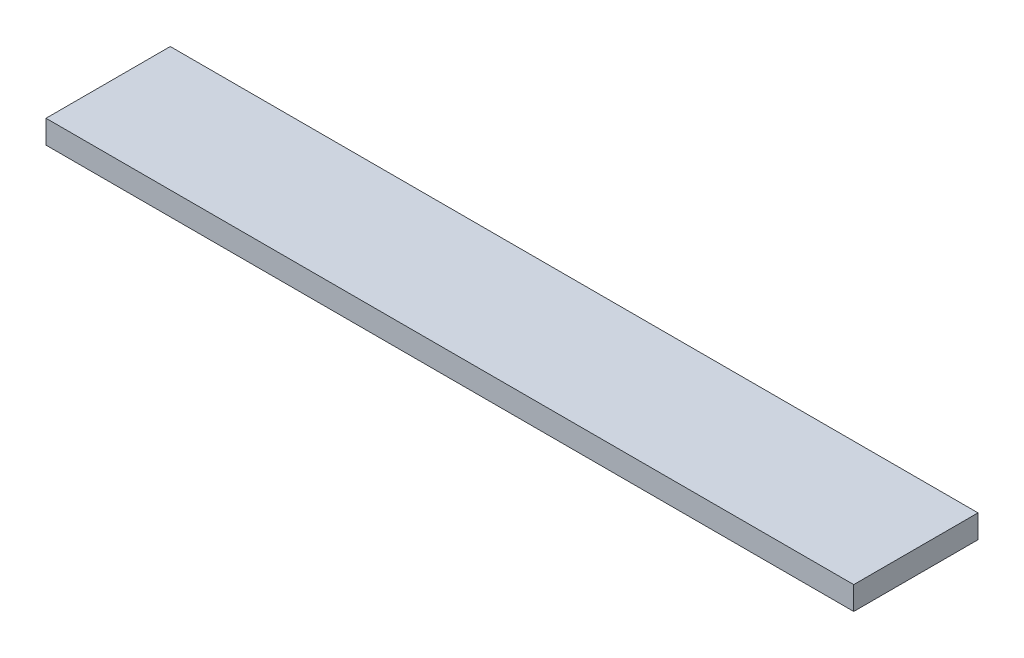
ISO-10303-21;
HEADER;
FILE_DESCRIPTION(('STEP AP214'),'2;1');
FILE_NAME('part.step','',(''),(''),'','','');
FILE_SCHEMA(('AUTOMOTIVE_DESIGN { 1 0 10303 214 1 1 1 1 }'));
ENDSEC;
DATA;
#1=APPLICATION_CONTEXT('core data for automotive mechanical design processes');
#2=APPLICATION_PROTOCOL_DEFINITION('international standard','automotive_design',2000,#1);
#3=PRODUCT_CONTEXT('',#1,'mechanical');
#4=PRODUCT('Part','Part','',(#3));
#5=PRODUCT_RELATED_PRODUCT_CATEGORY('part','',(#4));
#6=PRODUCT_DEFINITION_FORMATION('','',#4);
#7=PRODUCT_DEFINITION_CONTEXT('part definition',#1,'design');
#8=PRODUCT_DEFINITION('design','',#6,#7);
#9=PRODUCT_DEFINITION_SHAPE('','',#8);
#10=(LENGTH_UNIT() NAMED_UNIT(*) SI_UNIT(.MILLI.,.METRE.));
#11=(NAMED_UNIT(*) PLANE_ANGLE_UNIT() SI_UNIT($,.RADIAN.));
#12=(NAMED_UNIT(*) SI_UNIT($,.STERADIAN.) SOLID_ANGLE_UNIT());
#13=UNCERTAINTY_MEASURE_WITH_UNIT(LENGTH_MEASURE(1.E-05),#10,'distance_accuracy_value','');
#14=(GEOMETRIC_REPRESENTATION_CONTEXT(3) GLOBAL_UNCERTAINTY_ASSIGNED_CONTEXT((#13)) GLOBAL_UNIT_ASSIGNED_CONTEXT((#10,
#11,#12)) REPRESENTATION_CONTEXT('',''));
#15=CARTESIAN_POINT('',(0.,0.,0.));
#16=DIRECTION('',(0.,0.,1.));
#17=DIRECTION('',(1.,0.,0.));
#18=AXIS2_PLACEMENT_3D('',#15,#16,#17);
#19=CARTESIAN_POINT('',(0.,4.7625,0.));
#20=DIRECTION('',(1.,0.,0.));
#21=DIRECTION('',(0.,0.,-1.));
#22=AXIS2_PLACEMENT_3D('',#19,#20,#21);
#23=PLANE('',#22);
#24=DIRECTION('',(0.,0.,1.));
#25=VECTOR('',#24,1.);
#26=CARTESIAN_POINT('',(0.,0.,0.));
#27=LINE('',#26,#25);
#28=CARTESIAN_POINT('',(0.,0.,0.));
#29=VERTEX_POINT('',#28);
#30=CARTESIAN_POINT('',(0.,0.,25.4));
#31=VERTEX_POINT('',#30);
#32=EDGE_CURVE('E96',#29,#31,#27,.T.);
#33=ORIENTED_EDGE('',*,*,#32,.T.);
#34=DIRECTION('',(0.,-1.,0.));
#35=VECTOR('',#34,1.);
#36=CARTESIAN_POINT('',(0.,4.7625,25.4));
#37=LINE('',#36,#35);
#38=CARTESIAN_POINT('',(0.,4.7625,25.4));
#39=VERTEX_POINT('',#38);
#40=EDGE_CURVE('E11',#39,#31,#37,.T.);
#41=ORIENTED_EDGE('',*,*,#40,.F.);
#42=DIRECTION('',(0.,0.,1.));
#43=VECTOR('',#42,1.);
#44=CARTESIAN_POINT('',(0.,4.7625,0.));
#45=LINE('',#44,#43);
#46=CARTESIAN_POINT('',(0.,4.7625,0.));
#47=VERTEX_POINT('',#46);
#48=EDGE_CURVE('E82',#47,#39,#45,.T.);
#49=ORIENTED_EDGE('',*,*,#48,.F.);
#50=DIRECTION('',(0.,-1.,0.));
#51=VECTOR('',#50,1.);
#52=CARTESIAN_POINT('',(0.,4.7625,0.));
#53=LINE('',#52,#51);
#54=EDGE_CURVE('E49',#47,#29,#53,.T.);
#55=ORIENTED_EDGE('',*,*,#54,.T.);
#56=EDGE_LOOP('',(#33,#41,#49,#55));
#57=FACE_BOUND('',#56,.T.);
#58=ADVANCED_FACE('F33',(#57),#23,.F.);
#59=CARTESIAN_POINT('',(0.,4.7625,25.4));
#60=DIRECTION('',(0.,0.,-1.));
#61=DIRECTION('',(-1.,0.,0.));
#62=AXIS2_PLACEMENT_3D('',#59,#60,#61);
#63=PLANE('',#62);
#64=DIRECTION('',(1.,0.,0.));
#65=VECTOR('',#64,1.);
#66=CARTESIAN_POINT('',(0.,0.,25.4));
#67=LINE('',#66,#65);
#68=CARTESIAN_POINT('',(165.1,0.,25.4));
#69=VERTEX_POINT('',#68);
#70=EDGE_CURVE('E87',#31,#69,#67,.T.);
#71=ORIENTED_EDGE('',*,*,#70,.T.);
#72=DIRECTION('',(0.,-1.,0.));
#73=VECTOR('',#72,1.);
#74=CARTESIAN_POINT('',(165.1,4.7625,25.4));
#75=LINE('',#74,#73);
#76=CARTESIAN_POINT('',(165.1,4.7625,25.4));
#77=VERTEX_POINT('',#76);
#78=EDGE_CURVE('E41',#77,#69,#75,.T.);
#79=ORIENTED_EDGE('',*,*,#78,.F.);
#80=DIRECTION('',(1.,0.,0.));
#81=VECTOR('',#80,1.);
#82=CARTESIAN_POINT('',(0.,4.7625,25.4));
#83=LINE('',#82,#81);
#84=EDGE_CURVE('E74',#39,#77,#83,.T.);
#85=ORIENTED_EDGE('',*,*,#84,.F.);
#86=ORIENTED_EDGE('',*,*,#40,.T.);
#87=EDGE_LOOP('',(#71,#79,#85,#86));
#88=FACE_BOUND('',#87,.T.);
#89=ADVANCED_FACE('F86',(#88),#63,.F.);
#90=CARTESIAN_POINT('',(165.1,4.7625,0.));
#91=DIRECTION('',(1.,0.,0.));
#92=DIRECTION('',(0.,0.,-1.));
#93=AXIS2_PLACEMENT_3D('',#90,#91,#92);
#94=PLANE('',#93);
#95=DIRECTION('',(0.,0.,1.));
#96=VECTOR('',#95,1.);
#97=CARTESIAN_POINT('',(165.1,0.,0.));
#98=LINE('',#97,#96);
#99=CARTESIAN_POINT('',(165.1,0.,0.));
#100=VERTEX_POINT('',#99);
#101=EDGE_CURVE('E99',#100,#69,#98,.T.);
#102=ORIENTED_EDGE('',*,*,#101,.F.);
#103=DIRECTION('',(0.,-1.,0.));
#104=VECTOR('',#103,1.);
#105=CARTESIAN_POINT('',(165.1,4.7625,0.));
#106=LINE('',#105,#104);
#107=CARTESIAN_POINT('',(165.1,4.7625,0.));
#108=VERTEX_POINT('',#107);
#109=EDGE_CURVE('E63',#108,#100,#106,.T.);
#110=ORIENTED_EDGE('',*,*,#109,.F.);
#111=DIRECTION('',(0.,0.,1.));
#112=VECTOR('',#111,1.);
#113=CARTESIAN_POINT('',(165.1,4.7625,0.));
#114=LINE('',#113,#112);
#115=EDGE_CURVE('E81',#108,#77,#114,.T.);
#116=ORIENTED_EDGE('',*,*,#115,.T.);
#117=ORIENTED_EDGE('',*,*,#78,.T.);
#118=EDGE_LOOP('',(#102,#110,#116,#117));
#119=FACE_BOUND('',#118,.T.);
#120=ADVANCED_FACE('F90',(#119),#94,.T.);
#121=CARTESIAN_POINT('',(0.,4.7625,0.));
#122=DIRECTION('',(0.,0.,-1.));
#123=DIRECTION('',(-1.,0.,0.));
#124=AXIS2_PLACEMENT_3D('',#121,#122,#123);
#125=PLANE('',#124);
#126=DIRECTION('',(1.,0.,0.));
#127=VECTOR('',#126,1.);
#128=CARTESIAN_POINT('',(0.,0.,0.));
#129=LINE('',#128,#127);
#130=EDGE_CURVE('E101',#29,#100,#129,.T.);
#131=ORIENTED_EDGE('',*,*,#130,.F.);
#132=ORIENTED_EDGE('',*,*,#54,.F.);
#133=DIRECTION('',(1.,0.,0.));
#134=VECTOR('',#133,1.);
#135=CARTESIAN_POINT('',(0.,4.7625,0.));
#136=LINE('',#135,#134);
#137=EDGE_CURVE('E91',#47,#108,#136,.T.);
#138=ORIENTED_EDGE('',*,*,#137,.T.);
#139=ORIENTED_EDGE('',*,*,#109,.T.);
#140=EDGE_LOOP('',(#131,#132,#138,#139));
#141=FACE_BOUND('',#140,.T.);
#142=ADVANCED_FACE('F107',(#141),#125,.T.);
#143=CARTESIAN_POINT('',(0.,4.7625,0.));
#144=DIRECTION('',(0.,1.,0.));
#145=DIRECTION('',(0.,0.,1.));
#146=AXIS2_PLACEMENT_3D('',#143,#144,#145);
#147=PLANE('',#146);
#148=ORIENTED_EDGE('',*,*,#48,.T.);
#149=ORIENTED_EDGE('',*,*,#84,.T.);
#150=ORIENTED_EDGE('',*,*,#115,.F.);
#151=ORIENTED_EDGE('',*,*,#137,.F.);
#152=EDGE_LOOP('',(#148,#149,#150,#151));
#153=FACE_BOUND('',#152,.T.);
#154=ADVANCED_FACE('F78',(#153),#147,.T.);
#155=CARTESIAN_POINT('',(0.,0.,0.));
#156=DIRECTION('',(0.,1.,0.));
#157=DIRECTION('',(0.,0.,1.));
#158=AXIS2_PLACEMENT_3D('',#155,#156,#157);
#159=PLANE('',#158);
#160=ORIENTED_EDGE('',*,*,#32,.F.);
#161=ORIENTED_EDGE('',*,*,#130,.T.);
#162=ORIENTED_EDGE('',*,*,#101,.T.);
#163=ORIENTED_EDGE('',*,*,#70,.F.);
#164=EDGE_LOOP('',(#160,#161,#162,#163));
#165=FACE_BOUND('',#164,.T.);
#166=ADVANCED_FACE('F106',(#165),#159,.F.);
#167=CLOSED_SHELL('',(#58,#89,#120,#142,#154,#166));
#168=MANIFOLD_SOLID_BREP('B2',#167);
#169=ADVANCED_BREP_SHAPE_REPRESENTATION('',(#18,#168),#14);
#170=SHAPE_DEFINITION_REPRESENTATION(#9,#169);
ENDSEC;
END-ISO-10303-21;
